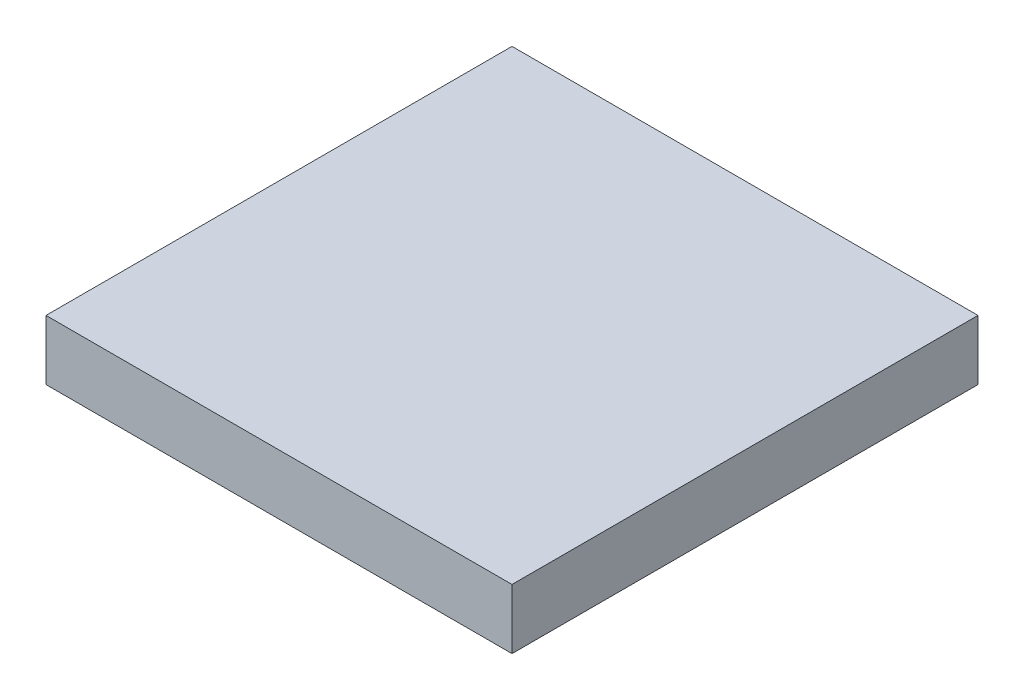
ISO-10303-21;
HEADER;
FILE_DESCRIPTION(('STEP AP214'),'2;1');
FILE_NAME('part.step','',(''),(''),'','','');
FILE_SCHEMA(('AUTOMOTIVE_DESIGN { 1 0 10303 214 1 1 1 1 }'));
ENDSEC;
DATA;
#1=APPLICATION_CONTEXT('core data for automotive mechanical design processes');
#2=APPLICATION_PROTOCOL_DEFINITION('international standard','automotive_design',2000,#1);
#3=PRODUCT_CONTEXT('',#1,'mechanical');
#4=PRODUCT('Part','Part','',(#3));
#5=PRODUCT_RELATED_PRODUCT_CATEGORY('part','',(#4));
#6=PRODUCT_DEFINITION_FORMATION('','',#4);
#7=PRODUCT_DEFINITION_CONTEXT('part definition',#1,'design');
#8=PRODUCT_DEFINITION('design','',#6,#7);
#9=PRODUCT_DEFINITION_SHAPE('','',#8);
#10=(LENGTH_UNIT() NAMED_UNIT(*) SI_UNIT(.MILLI.,.METRE.));
#11=(NAMED_UNIT(*) PLANE_ANGLE_UNIT() SI_UNIT($,.RADIAN.));
#12=(NAMED_UNIT(*) SI_UNIT($,.STERADIAN.) SOLID_ANGLE_UNIT());
#13=UNCERTAINTY_MEASURE_WITH_UNIT(LENGTH_MEASURE(1.E-05),#10,'distance_accuracy_value','');
#14=(GEOMETRIC_REPRESENTATION_CONTEXT(3) GLOBAL_UNCERTAINTY_ASSIGNED_CONTEXT((#13)) GLOBAL_UNIT_ASSIGNED_CONTEXT((#10,
#11,#12)) REPRESENTATION_CONTEXT('',''));
#15=CARTESIAN_POINT('',(0.,0.,0.));
#16=DIRECTION('',(0.,0.,1.));
#17=DIRECTION('',(1.,0.,0.));
#18=AXIS2_PLACEMENT_3D('',#15,#16,#17);
#19=CARTESIAN_POINT('',(3.5,0.9,-3.5));
#20=DIRECTION('',(-1.,0.,0.));
#21=DIRECTION('',(0.,0.,1.));
#22=AXIS2_PLACEMENT_3D('',#19,#20,#21);
#23=PLANE('',#22);
#24=DIRECTION('',(0.,0.,-1.));
#25=VECTOR('',#24,1.);
#26=CARTESIAN_POINT('',(3.5,0.,-3.5));
#27=LINE('',#26,#25);
#28=CARTESIAN_POINT('',(3.5,0.,3.5));
#29=VERTEX_POINT('',#28);
#30=CARTESIAN_POINT('',(3.5,0.,-3.5));
#31=VERTEX_POINT('',#30);
#32=EDGE_CURVE('E96',#29,#31,#27,.T.);
#33=ORIENTED_EDGE('',*,*,#32,.T.);
#34=DIRECTION('',(0.,-1.,0.));
#35=VECTOR('',#34,1.);
#36=CARTESIAN_POINT('',(3.5,0.9,-3.5));
#37=LINE('',#36,#35);
#38=CARTESIAN_POINT('',(3.5,0.9,-3.5));
#39=VERTEX_POINT('',#38);
#40=EDGE_CURVE('E11',#39,#31,#37,.T.);
#41=ORIENTED_EDGE('',*,*,#40,.F.);
#42=DIRECTION('',(0.,0.,-1.));
#43=VECTOR('',#42,1.);
#44=CARTESIAN_POINT('',(3.5,0.9,-3.5));
#45=LINE('',#44,#43);
#46=CARTESIAN_POINT('',(3.5,0.9,3.5));
#47=VERTEX_POINT('',#46);
#48=EDGE_CURVE('E84',#47,#39,#45,.T.);
#49=ORIENTED_EDGE('',*,*,#48,.F.);
#50=DIRECTION('',(0.,-1.,0.));
#51=VECTOR('',#50,1.);
#52=CARTESIAN_POINT('',(3.5,0.9,3.5));
#53=LINE('',#52,#51);
#54=EDGE_CURVE('E92',#47,#29,#53,.T.);
#55=ORIENTED_EDGE('',*,*,#54,.T.);
#56=EDGE_LOOP('',(#33,#41,#49,#55));
#57=FACE_BOUND('',#56,.T.);
#58=ADVANCED_FACE('F33',(#57),#23,.F.);
#59=CARTESIAN_POINT('',(-3.5,0.9,-3.5));
#60=DIRECTION('',(0.,0.,1.));
#61=DIRECTION('',(1.,0.,0.));
#62=AXIS2_PLACEMENT_3D('',#59,#60,#61);
#63=PLANE('',#62);
#64=DIRECTION('',(-1.,0.,0.));
#65=VECTOR('',#64,1.);
#66=CARTESIAN_POINT('',(-3.5,0.,-3.5));
#67=LINE('',#66,#65);
#68=CARTESIAN_POINT('',(-3.5,0.,-3.5));
#69=VERTEX_POINT('',#68);
#70=EDGE_CURVE('E88',#31,#69,#67,.T.);
#71=ORIENTED_EDGE('',*,*,#70,.T.);
#72=DIRECTION('',(0.,-1.,0.));
#73=VECTOR('',#72,1.);
#74=CARTESIAN_POINT('',(-3.5,0.9,-3.5));
#75=LINE('',#74,#73);
#76=CARTESIAN_POINT('',(-3.5,0.9,-3.5));
#77=VERTEX_POINT('',#76);
#78=EDGE_CURVE('E41',#77,#69,#75,.T.);
#79=ORIENTED_EDGE('',*,*,#78,.F.);
#80=DIRECTION('',(-1.,0.,0.));
#81=VECTOR('',#80,1.);
#82=CARTESIAN_POINT('',(-3.5,0.9,-3.5));
#83=LINE('',#82,#81);
#84=EDGE_CURVE('E79',#39,#77,#83,.T.);
#85=ORIENTED_EDGE('',*,*,#84,.F.);
#86=ORIENTED_EDGE('',*,*,#40,.T.);
#87=EDGE_LOOP('',(#71,#79,#85,#86));
#88=FACE_BOUND('',#87,.T.);
#89=ADVANCED_FACE('F87',(#88),#63,.F.);
#90=CARTESIAN_POINT('',(-3.5,0.9,-3.5));
#91=DIRECTION('',(1.,0.,0.));
#92=DIRECTION('',(0.,0.,-1.));
#93=AXIS2_PLACEMENT_3D('',#90,#91,#92);
#94=PLANE('',#93);
#95=DIRECTION('',(0.,0.,1.));
#96=VECTOR('',#95,1.);
#97=CARTESIAN_POINT('',(-3.5,0.,-3.5));
#98=LINE('',#97,#96);
#99=CARTESIAN_POINT('',(-3.5,0.,3.5));
#100=VERTEX_POINT('',#99);
#101=EDGE_CURVE('E66',#69,#100,#98,.T.);
#102=ORIENTED_EDGE('',*,*,#101,.T.);
#103=DIRECTION('',(0.,-1.,0.));
#104=VECTOR('',#103,1.);
#105=CARTESIAN_POINT('',(-3.5,0.9,3.5));
#106=LINE('',#105,#104);
#107=CARTESIAN_POINT('',(-3.5,0.9,3.5));
#108=VERTEX_POINT('',#107);
#109=EDGE_CURVE('E89',#108,#100,#106,.T.);
#110=ORIENTED_EDGE('',*,*,#109,.F.);
#111=DIRECTION('',(0.,0.,1.));
#112=VECTOR('',#111,1.);
#113=CARTESIAN_POINT('',(-3.5,0.9,-3.5));
#114=LINE('',#113,#112);
#115=EDGE_CURVE('E82',#77,#108,#114,.T.);
#116=ORIENTED_EDGE('',*,*,#115,.F.);
#117=ORIENTED_EDGE('',*,*,#78,.T.);
#118=EDGE_LOOP('',(#102,#110,#116,#117));
#119=FACE_BOUND('',#118,.T.);
#120=ADVANCED_FACE('F90',(#119),#94,.F.);
#121=CARTESIAN_POINT('',(-3.5,0.9,3.5));
#122=DIRECTION('',(0.,0.,-1.));
#123=DIRECTION('',(-1.,0.,0.));
#124=AXIS2_PLACEMENT_3D('',#121,#122,#123);
#125=PLANE('',#124);
#126=DIRECTION('',(1.,0.,0.));
#127=VECTOR('',#126,1.);
#128=CARTESIAN_POINT('',(-3.5,0.,3.5));
#129=LINE('',#128,#127);
#130=EDGE_CURVE('E72',#100,#29,#129,.T.);
#131=ORIENTED_EDGE('',*,*,#130,.T.);
#132=ORIENTED_EDGE('',*,*,#54,.F.);
#133=DIRECTION('',(1.,0.,0.));
#134=VECTOR('',#133,1.);
#135=CARTESIAN_POINT('',(-3.5,0.9,3.5));
#136=LINE('',#135,#134);
#137=EDGE_CURVE('E49',#108,#47,#136,.T.);
#138=ORIENTED_EDGE('',*,*,#137,.F.);
#139=ORIENTED_EDGE('',*,*,#109,.T.);
#140=EDGE_LOOP('',(#131,#132,#138,#139));
#141=FACE_BOUND('',#140,.T.);
#142=ADVANCED_FACE('F103',(#141),#125,.F.);
#143=CARTESIAN_POINT('',(0.,0.9,0.));
#144=DIRECTION('',(0.,1.,0.));
#145=DIRECTION('',(0.,0.,1.));
#146=AXIS2_PLACEMENT_3D('',#143,#144,#145);
#147=PLANE('',#146);
#148=ORIENTED_EDGE('',*,*,#48,.T.);
#149=ORIENTED_EDGE('',*,*,#84,.T.);
#150=ORIENTED_EDGE('',*,*,#115,.T.);
#151=ORIENTED_EDGE('',*,*,#137,.T.);
#152=EDGE_LOOP('',(#148,#149,#150,#151));
#153=FACE_BOUND('',#152,.T.);
#154=ADVANCED_FACE('F80',(#153),#147,.T.);
#155=CARTESIAN_POINT('',(0.,0.,0.));
#156=DIRECTION('',(0.,1.,0.));
#157=DIRECTION('',(0.,0.,1.));
#158=AXIS2_PLACEMENT_3D('',#155,#156,#157);
#159=PLANE('',#158);
#160=ORIENTED_EDGE('',*,*,#32,.F.);
#161=ORIENTED_EDGE('',*,*,#130,.F.);
#162=ORIENTED_EDGE('',*,*,#101,.F.);
#163=ORIENTED_EDGE('',*,*,#70,.F.);
#164=EDGE_LOOP('',(#160,#161,#162,#163));
#165=FACE_BOUND('',#164,.T.);
#166=ADVANCED_FACE('F106',(#165),#159,.F.);
#167=CLOSED_SHELL('',(#58,#89,#120,#142,#154,#166));
#168=MANIFOLD_SOLID_BREP('B2',#167);
#169=ADVANCED_BREP_SHAPE_REPRESENTATION('',(#18,#168),#14);
#170=SHAPE_DEFINITION_REPRESENTATION(#9,#169);
ENDSEC;
END-ISO-10303-21;
